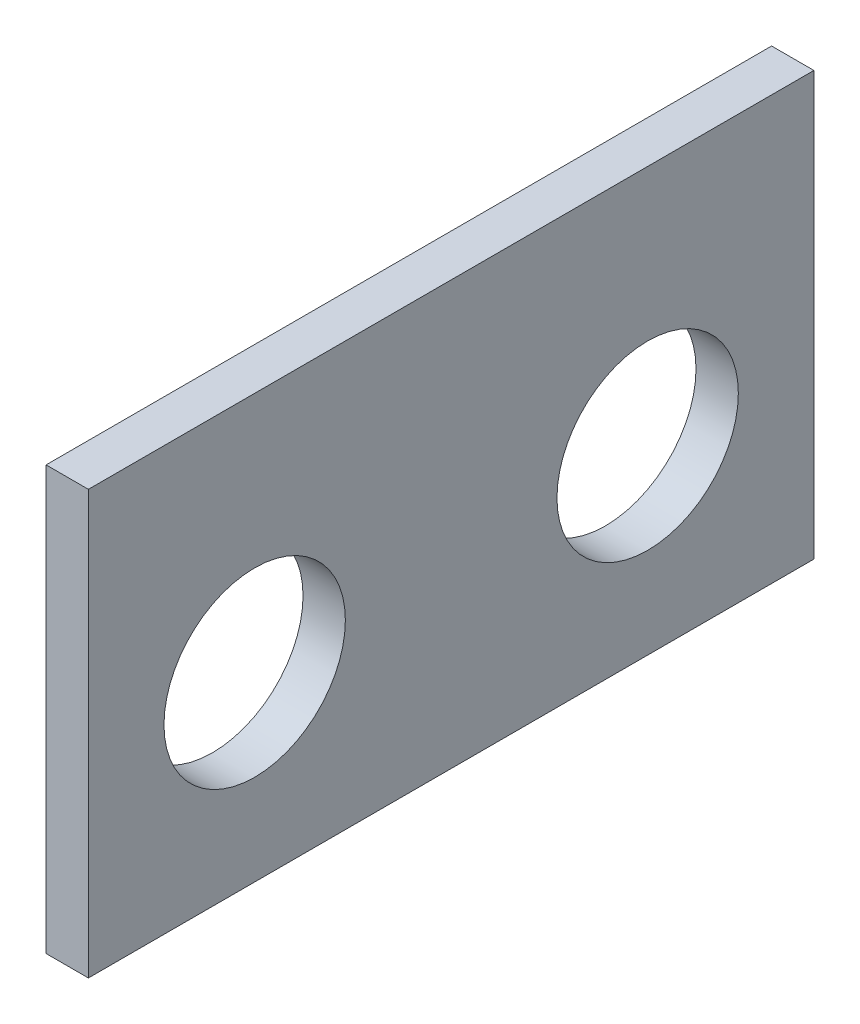
ISO-10303-21;
HEADER;
FILE_DESCRIPTION(('STEP AP214'),'2;1');
FILE_NAME('part.step','',(''),(''),'','','');
FILE_SCHEMA(('AUTOMOTIVE_DESIGN { 1 0 10303 214 1 1 1 1 }'));
ENDSEC;
DATA;
#1=APPLICATION_CONTEXT('core data for automotive mechanical design processes');
#2=APPLICATION_PROTOCOL_DEFINITION('international standard','automotive_design',2000,#1);
#3=PRODUCT_CONTEXT('',#1,'mechanical');
#4=PRODUCT('Part','Part','',(#3));
#5=PRODUCT_RELATED_PRODUCT_CATEGORY('part','',(#4));
#6=PRODUCT_DEFINITION_FORMATION('','',#4);
#7=PRODUCT_DEFINITION_CONTEXT('part definition',#1,'design');
#8=PRODUCT_DEFINITION('design','',#6,#7);
#9=PRODUCT_DEFINITION_SHAPE('','',#8);
#10=(LENGTH_UNIT() NAMED_UNIT(*) SI_UNIT(.MILLI.,.METRE.));
#11=(NAMED_UNIT(*) PLANE_ANGLE_UNIT() SI_UNIT($,.RADIAN.));
#12=(NAMED_UNIT(*) SI_UNIT($,.STERADIAN.) SOLID_ANGLE_UNIT());
#13=UNCERTAINTY_MEASURE_WITH_UNIT(LENGTH_MEASURE(1.E-05),#10,'distance_accuracy_value','');
#14=(GEOMETRIC_REPRESENTATION_CONTEXT(3) GLOBAL_UNCERTAINTY_ASSIGNED_CONTEXT((#13)) GLOBAL_UNIT_ASSIGNED_CONTEXT((#10,
#11,#12)) REPRESENTATION_CONTEXT('',''));
#15=CARTESIAN_POINT('',(0.,0.,0.));
#16=DIRECTION('',(0.,0.,1.));
#17=DIRECTION('',(1.,0.,0.));
#18=AXIS2_PLACEMENT_3D('',#15,#16,#17);
#19=CARTESIAN_POINT('',(0.7,0.,0.));
#20=DIRECTION('',(1.,0.,0.));
#21=DIRECTION('',(0.,0.,-1.));
#22=AXIS2_PLACEMENT_3D('',#19,#20,#21);
#23=PLANE('',#22);
#24=CARTESIAN_POINT('',(0.7,63.5747220858746,-170.213773135156));
#25=DIRECTION('',(1.,0.,0.));
#26=DIRECTION('',(0.,0.,-1.));
#27=AXIS2_PLACEMENT_3D('',#24,#25,#26);
#28=CIRCLE('',#27,1.5);
#29=CARTESIAN_POINT('',(0.7,63.5747220858746,-171.713773135156));
#30=VERTEX_POINT('',#29);
#31=EDGE_CURVE('E135',#30,#30,#28,.T.);
#32=ORIENTED_EDGE('',*,*,#31,.F.);
#33=EDGE_LOOP('',(#32));
#34=FACE_BOUND('',#33,.T.);
#35=DIRECTION('',(0.,0.,1.));
#36=VECTOR('',#35,1.);
#37=CARTESIAN_POINT('',(0.7,67.5747220858746,-172.963773135156));
#38=LINE('',#37,#36);
#39=CARTESIAN_POINT('',(0.7,67.5747220858746,-172.963773135156));
#40=VERTEX_POINT('',#39);
#41=CARTESIAN_POINT('',(0.7,67.5747220858746,-160.963773135156));
#42=VERTEX_POINT('',#41);
#43=EDGE_CURVE('E119',#40,#42,#38,.T.);
#44=ORIENTED_EDGE('',*,*,#43,.T.);
#45=DIRECTION('',(0.,-1.,0.));
#46=VECTOR('',#45,1.);
#47=CARTESIAN_POINT('',(0.7,67.5747220858746,-160.963773135156));
#48=LINE('',#47,#46);
#49=CARTESIAN_POINT('',(0.7,60.5747220858746,-160.963773135156));
#50=VERTEX_POINT('',#49);
#51=EDGE_CURVE('E111',#42,#50,#48,.T.);
#52=ORIENTED_EDGE('',*,*,#51,.T.);
#53=DIRECTION('',(0.,0.,1.));
#54=VECTOR('',#53,1.);
#55=CARTESIAN_POINT('',(0.7,60.5747220858746,-172.963773135156));
#56=LINE('',#55,#54);
#57=CARTESIAN_POINT('',(0.7,60.5747220858746,-172.963773135156));
#58=VERTEX_POINT('',#57);
#59=EDGE_CURVE('E118',#58,#50,#56,.T.);
#60=ORIENTED_EDGE('',*,*,#59,.F.);
#61=DIRECTION('',(0.,-1.,0.));
#62=VECTOR('',#61,1.);
#63=CARTESIAN_POINT('',(0.7,67.5747220858746,-172.963773135156));
#64=LINE('',#63,#62);
#65=EDGE_CURVE('E128',#40,#58,#64,.T.);
#66=ORIENTED_EDGE('',*,*,#65,.F.);
#67=EDGE_LOOP('',(#44,#52,#60,#66));
#68=FACE_BOUND('',#67,.T.);
#69=CARTESIAN_POINT('',(0.7,63.5747220858746,-163.713773135156));
#70=DIRECTION('',(1.,0.,0.));
#71=DIRECTION('',(0.,0.,-1.));
#72=AXIS2_PLACEMENT_3D('',#69,#70,#71);
#73=CIRCLE('',#72,1.5);
#74=CARTESIAN_POINT('',(0.7,63.5747220858746,-165.213773135156));
#75=VERTEX_POINT('',#74);
#76=EDGE_CURVE('E148',#75,#75,#73,.T.);
#77=ORIENTED_EDGE('',*,*,#76,.F.);
#78=EDGE_LOOP('',(#77));
#79=FACE_BOUND('',#78,.T.);
#80=ADVANCED_FACE('F69',(#34,#68,#79),#23,.T.);
#81=CARTESIAN_POINT('',(0.,0.,0.));
#82=DIRECTION('',(1.,0.,0.));
#83=DIRECTION('',(0.,0.,-1.));
#84=AXIS2_PLACEMENT_3D('',#81,#82,#83);
#85=PLANE('',#84);
#86=DIRECTION('',(0.,0.,1.));
#87=VECTOR('',#86,1.);
#88=CARTESIAN_POINT('',(0.,67.5747220858746,-172.963773135156));
#89=LINE('',#88,#87);
#90=CARTESIAN_POINT('',(0.,67.5747220858746,-172.963773135156));
#91=VERTEX_POINT('',#90);
#92=CARTESIAN_POINT('',(0.,67.5747220858746,-160.963773135156));
#93=VERTEX_POINT('',#92);
#94=EDGE_CURVE('E133',#91,#93,#89,.T.);
#95=ORIENTED_EDGE('',*,*,#94,.F.);
#96=DIRECTION('',(0.,-1.,0.));
#97=VECTOR('',#96,1.);
#98=CARTESIAN_POINT('',(0.,67.5747220858746,-172.963773135156));
#99=LINE('',#98,#97);
#100=CARTESIAN_POINT('',(0.,60.5747220858746,-172.963773135156));
#101=VERTEX_POINT('',#100);
#102=EDGE_CURVE('E139',#91,#101,#99,.T.);
#103=ORIENTED_EDGE('',*,*,#102,.T.);
#104=DIRECTION('',(0.,0.,1.));
#105=VECTOR('',#104,1.);
#106=CARTESIAN_POINT('',(0.,60.5747220858746,-172.963773135156));
#107=LINE('',#106,#105);
#108=CARTESIAN_POINT('',(0.,60.5747220858746,-160.963773135156));
#109=VERTEX_POINT('',#108);
#110=EDGE_CURVE('E137',#101,#109,#107,.T.);
#111=ORIENTED_EDGE('',*,*,#110,.T.);
#112=DIRECTION('',(0.,-1.,0.));
#113=VECTOR('',#112,1.);
#114=CARTESIAN_POINT('',(0.,67.5747220858746,-160.963773135156));
#115=LINE('',#114,#113);
#116=EDGE_CURVE('E124',#93,#109,#115,.T.);
#117=ORIENTED_EDGE('',*,*,#116,.F.);
#118=EDGE_LOOP('',(#95,#103,#111,#117));
#119=FACE_BOUND('',#118,.T.);
#120=CARTESIAN_POINT('',(0.,63.5747220858746,-170.213773135156));
#121=DIRECTION('',(1.,0.,0.));
#122=DIRECTION('',(0.,0.,-1.));
#123=AXIS2_PLACEMENT_3D('',#120,#121,#122);
#124=CIRCLE('',#123,1.5);
#125=CARTESIAN_POINT('',(0.,63.5747220858746,-171.713773135156));
#126=VERTEX_POINT('',#125);
#127=EDGE_CURVE('E145',#126,#126,#124,.T.);
#128=ORIENTED_EDGE('',*,*,#127,.T.);
#129=EDGE_LOOP('',(#128));
#130=FACE_BOUND('',#129,.T.);
#131=CARTESIAN_POINT('',(0.,63.5747220858746,-163.713773135156));
#132=DIRECTION('',(1.,0.,0.));
#133=DIRECTION('',(0.,0.,-1.));
#134=AXIS2_PLACEMENT_3D('',#131,#132,#133);
#135=CIRCLE('',#134,1.5);
#136=CARTESIAN_POINT('',(0.,63.5747220858746,-165.213773135156));
#137=VERTEX_POINT('',#136);
#138=EDGE_CURVE('E151',#137,#137,#135,.T.);
#139=ORIENTED_EDGE('',*,*,#138,.T.);
#140=EDGE_LOOP('',(#139));
#141=FACE_BOUND('',#140,.T.);
#142=ADVANCED_FACE('F160',(#119,#130,#141),#85,.F.);
#143=CARTESIAN_POINT('',(0.7,67.5747220858746,-172.963773135156));
#144=DIRECTION('',(0.,-1.,0.));
#145=DIRECTION('',(0.,0.,-1.));
#146=AXIS2_PLACEMENT_3D('',#143,#144,#145);
#147=PLANE('',#146);
#148=ORIENTED_EDGE('',*,*,#94,.T.);
#149=DIRECTION('',(-1.,0.,0.));
#150=VECTOR('',#149,1.);
#151=CARTESIAN_POINT('',(0.7,67.5747220858746,-160.963773135156));
#152=LINE('',#151,#150);
#153=EDGE_CURVE('E12',#42,#93,#152,.T.);
#154=ORIENTED_EDGE('',*,*,#153,.F.);
#155=ORIENTED_EDGE('',*,*,#43,.F.);
#156=DIRECTION('',(-1.,0.,0.));
#157=VECTOR('',#156,1.);
#158=CARTESIAN_POINT('',(0.7,67.5747220858746,-172.963773135156));
#159=LINE('',#158,#157);
#160=EDGE_CURVE('E86',#40,#91,#159,.T.);
#161=ORIENTED_EDGE('',*,*,#160,.T.);
#162=EDGE_LOOP('',(#148,#154,#155,#161));
#163=FACE_BOUND('',#162,.T.);
#164=ADVANCED_FACE('F71',(#163),#147,.F.);
#165=CARTESIAN_POINT('',(0.7,67.5747220858746,-160.963773135156));
#166=DIRECTION('',(0.,0.,-1.));
#167=DIRECTION('',(-1.,0.,0.));
#168=AXIS2_PLACEMENT_3D('',#165,#166,#167);
#169=PLANE('',#168);
#170=ORIENTED_EDGE('',*,*,#116,.T.);
#171=DIRECTION('',(-1.,0.,0.));
#172=VECTOR('',#171,1.);
#173=CARTESIAN_POINT('',(0.7,60.5747220858746,-160.963773135156));
#174=LINE('',#173,#172);
#175=EDGE_CURVE('E78',#50,#109,#174,.T.);
#176=ORIENTED_EDGE('',*,*,#175,.F.);
#177=ORIENTED_EDGE('',*,*,#51,.F.);
#178=ORIENTED_EDGE('',*,*,#153,.T.);
#179=EDGE_LOOP('',(#170,#176,#177,#178));
#180=FACE_BOUND('',#179,.T.);
#181=ADVANCED_FACE('F123',(#180),#169,.F.);
#182=CARTESIAN_POINT('',(0.7,60.5747220858746,-172.963773135156));
#183=DIRECTION('',(0.,-1.,0.));
#184=DIRECTION('',(0.,0.,-1.));
#185=AXIS2_PLACEMENT_3D('',#182,#183,#184);
#186=PLANE('',#185);
#187=ORIENTED_EDGE('',*,*,#110,.F.);
#188=DIRECTION('',(-1.,0.,0.));
#189=VECTOR('',#188,1.);
#190=CARTESIAN_POINT('',(0.7,60.5747220858746,-172.963773135156));
#191=LINE('',#190,#189);
#192=EDGE_CURVE('E100',#58,#101,#191,.T.);
#193=ORIENTED_EDGE('',*,*,#192,.F.);
#194=ORIENTED_EDGE('',*,*,#59,.T.);
#195=ORIENTED_EDGE('',*,*,#175,.T.);
#196=EDGE_LOOP('',(#187,#193,#194,#195));
#197=FACE_BOUND('',#196,.T.);
#198=ADVANCED_FACE('F127',(#197),#186,.T.);
#199=CARTESIAN_POINT('',(0.7,67.5747220858746,-172.963773135156));
#200=DIRECTION('',(0.,0.,-1.));
#201=DIRECTION('',(-1.,0.,0.));
#202=AXIS2_PLACEMENT_3D('',#199,#200,#201);
#203=PLANE('',#202);
#204=ORIENTED_EDGE('',*,*,#102,.F.);
#205=ORIENTED_EDGE('',*,*,#160,.F.);
#206=ORIENTED_EDGE('',*,*,#65,.T.);
#207=ORIENTED_EDGE('',*,*,#192,.T.);
#208=EDGE_LOOP('',(#204,#205,#206,#207));
#209=FACE_BOUND('',#208,.T.);
#210=ADVANCED_FACE('F172',(#209),#203,.T.);
#211=CARTESIAN_POINT('',(0.7,63.5747220858746,-170.213773135156));
#212=DIRECTION('',(-1.,0.,0.));
#213=DIRECTION('',(0.,0.,1.));
#214=AXIS2_PLACEMENT_3D('',#211,#212,#213);
#215=CYLINDRICAL_SURFACE('',#214,1.5);
#216=ORIENTED_EDGE('',*,*,#31,.T.);
#217=EDGE_LOOP('',(#216));
#218=FACE_BOUND('',#217,.T.);
#219=ORIENTED_EDGE('',*,*,#127,.F.);
#220=EDGE_LOOP('',(#219));
#221=FACE_BOUND('',#220,.T.);
#222=ADVANCED_FACE('F169',(#218,#221),#215,.F.);
#223=CARTESIAN_POINT('',(0.7,63.5747220858746,-163.713773135156));
#224=DIRECTION('',(-1.,0.,0.));
#225=DIRECTION('',(0.,0.,1.));
#226=AXIS2_PLACEMENT_3D('',#223,#224,#225);
#227=CYLINDRICAL_SURFACE('',#226,1.5);
#228=ORIENTED_EDGE('',*,*,#76,.T.);
#229=EDGE_LOOP('',(#228));
#230=FACE_BOUND('',#229,.T.);
#231=ORIENTED_EDGE('',*,*,#138,.F.);
#232=EDGE_LOOP('',(#231));
#233=FACE_BOUND('',#232,.T.);
#234=ADVANCED_FACE('F157',(#230,#233),#227,.F.);
#235=CLOSED_SHELL('',(#80,#142,#164,#181,#198,#210,#222,#234));
#236=MANIFOLD_SOLID_BREP('B2',#235);
#237=ADVANCED_BREP_SHAPE_REPRESENTATION('',(#18,#236),#14);
#238=SHAPE_DEFINITION_REPRESENTATION(#9,#237);
ENDSEC;
END-ISO-10303-21;
